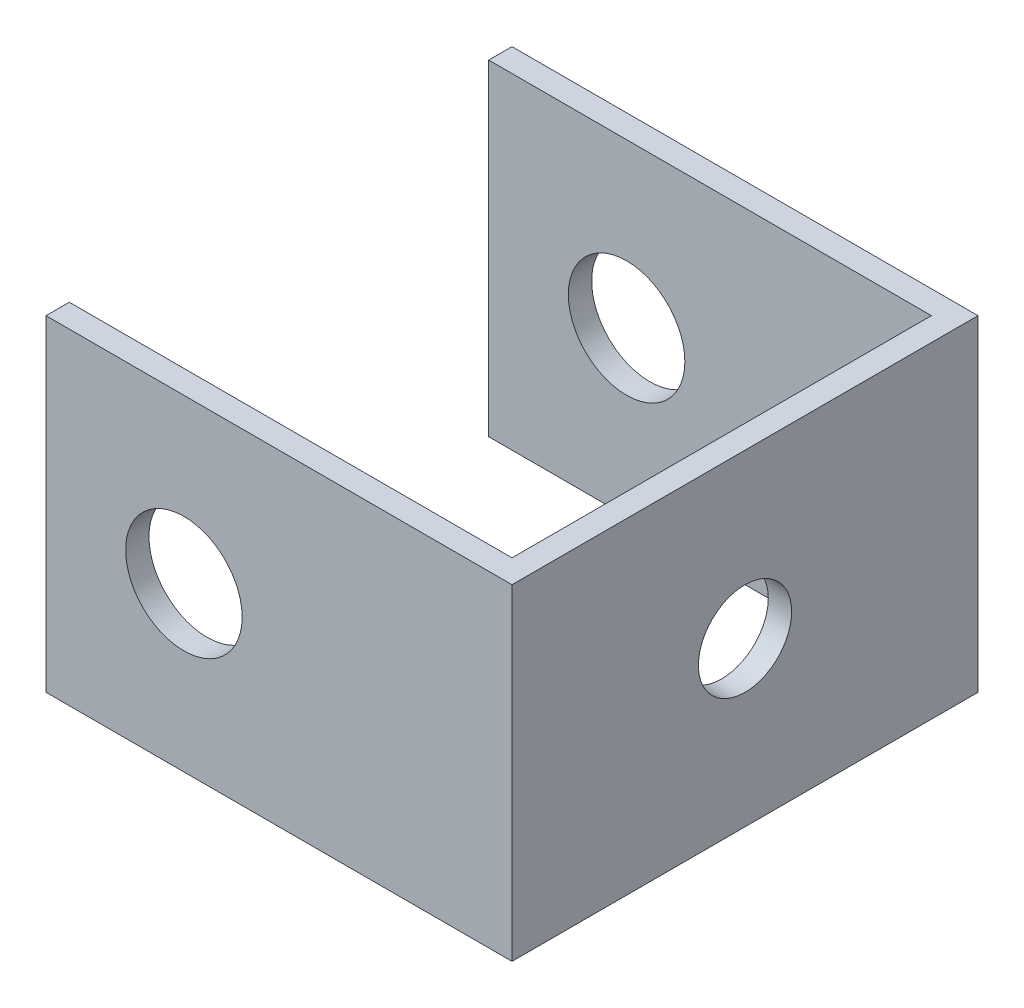
ISO-10303-21;
HEADER;
FILE_DESCRIPTION(('STEP AP214'),'2;1');
FILE_NAME('part.step','',(''),(''),'','','');
FILE_SCHEMA(('AUTOMOTIVE_DESIGN { 1 0 10303 214 1 1 1 1 }'));
ENDSEC;
DATA;
#1=APPLICATION_CONTEXT('core data for automotive mechanical design processes');
#2=APPLICATION_PROTOCOL_DEFINITION('international standard','automotive_design',2000,#1);
#3=PRODUCT_CONTEXT('',#1,'mechanical');
#4=PRODUCT('Part','Part','',(#3));
#5=PRODUCT_RELATED_PRODUCT_CATEGORY('part','',(#4));
#6=PRODUCT_DEFINITION_FORMATION('','',#4);
#7=PRODUCT_DEFINITION_CONTEXT('part definition',#1,'design');
#8=PRODUCT_DEFINITION('design','',#6,#7);
#9=PRODUCT_DEFINITION_SHAPE('','',#8);
#10=(LENGTH_UNIT() NAMED_UNIT(*) SI_UNIT(.MILLI.,.METRE.));
#11=(NAMED_UNIT(*) PLANE_ANGLE_UNIT() SI_UNIT($,.RADIAN.));
#12=(NAMED_UNIT(*) SI_UNIT($,.STERADIAN.) SOLID_ANGLE_UNIT());
#13=UNCERTAINTY_MEASURE_WITH_UNIT(LENGTH_MEASURE(1.E-05),#10,'distance_accuracy_value','');
#14=(GEOMETRIC_REPRESENTATION_CONTEXT(3) GLOBAL_UNCERTAINTY_ASSIGNED_CONTEXT((#13)) GLOBAL_UNIT_ASSIGNED_CONTEXT((#10,
#11,#12)) REPRESENTATION_CONTEXT('',''));
#15=CARTESIAN_POINT('',(0.,0.,0.));
#16=DIRECTION('',(0.,0.,1.));
#17=DIRECTION('',(1.,0.,0.));
#18=AXIS2_PLACEMENT_3D('',#15,#16,#17);
#19=CARTESIAN_POINT('',(0.,14.,-8.99999999999999));
#20=DIRECTION('',(0.,0.,-1.));
#21=DIRECTION('',(-1.,0.,0.));
#22=AXIS2_PLACEMENT_3D('',#19,#20,#21);
#23=PLANE('',#22);
#24=CARTESIAN_POINT('',(-4.08171011667946,7.,-8.99999999999999));
#25=DIRECTION('',(0.,0.,-1.));
#26=DIRECTION('',(-1.,0.,0.));
#27=AXIS2_PLACEMENT_3D('',#24,#25,#26);
#28=CIRCLE('',#27,2.5);
#29=CARTESIAN_POINT('',(-6.58171011667946,7.,-8.99999999999999));
#30=VERTEX_POINT('',#29);
#31=EDGE_CURVE('E136',#30,#30,#28,.T.);
#32=ORIENTED_EDGE('',*,*,#31,.T.);
#33=EDGE_LOOP('',(#32));
#34=FACE_BOUND('',#33,.T.);
#35=DIRECTION('',(1.,0.,0.));
#36=VECTOR('',#35,1.);
#37=CARTESIAN_POINT('',(0.,0.,-8.99999999999999));
#38=LINE('',#37,#36);
#39=CARTESIAN_POINT('',(-10.,0.,-8.99999999999999));
#40=VERTEX_POINT('',#39);
#41=CARTESIAN_POINT('',(9.,0.,-8.99999999999999));
#42=VERTEX_POINT('',#41);
#43=EDGE_CURVE('E133',#40,#42,#38,.T.);
#44=ORIENTED_EDGE('',*,*,#43,.T.);
#45=DIRECTION('',(0.,-1.,0.));
#46=VECTOR('',#45,1.);
#47=CARTESIAN_POINT('',(9.,14.,-8.99999999999999));
#48=LINE('',#47,#46);
#49=CARTESIAN_POINT('',(9.,14.,-8.99999999999999));
#50=VERTEX_POINT('',#49);
#51=EDGE_CURVE('E11',#50,#42,#48,.T.);
#52=ORIENTED_EDGE('',*,*,#51,.F.);
#53=DIRECTION('',(1.,0.,0.));
#54=VECTOR('',#53,1.);
#55=CARTESIAN_POINT('',(0.,14.,-8.99999999999999));
#56=LINE('',#55,#54);
#57=CARTESIAN_POINT('',(-10.,14.,-8.99999999999999));
#58=VERTEX_POINT('',#57);
#59=EDGE_CURVE('E174',#58,#50,#56,.T.);
#60=ORIENTED_EDGE('',*,*,#59,.F.);
#61=DIRECTION('',(0.,-1.,0.));
#62=VECTOR('',#61,1.);
#63=CARTESIAN_POINT('',(-10.,14.,-8.99999999999999));
#64=LINE('',#63,#62);
#65=EDGE_CURVE('E51',#58,#40,#64,.T.);
#66=ORIENTED_EDGE('',*,*,#65,.T.);
#67=EDGE_LOOP('',(#44,#52,#60,#66));
#68=FACE_BOUND('',#67,.T.);
#69=ADVANCED_FACE('F35',(#34,#68),#23,.F.);
#70=CARTESIAN_POINT('',(9.,14.,0.));
#71=DIRECTION('',(1.,0.,0.));
#72=DIRECTION('',(0.,0.,-1.));
#73=AXIS2_PLACEMENT_3D('',#70,#71,#72);
#74=PLANE('',#73);
#75=CARTESIAN_POINT('',(9.,7.,0.));
#76=DIRECTION('',(1.,0.,0.));
#77=DIRECTION('',(0.,0.,-1.));
#78=AXIS2_PLACEMENT_3D('',#75,#76,#77);
#79=CIRCLE('',#78,2.);
#80=CARTESIAN_POINT('',(9.,7.,-2.));
#81=VERTEX_POINT('',#80);
#82=EDGE_CURVE('E192',#81,#81,#79,.F.);
#83=ORIENTED_EDGE('',*,*,#82,.F.);
#84=EDGE_LOOP('',(#83));
#85=FACE_BOUND('',#84,.T.);
#86=DIRECTION('',(0.,0.,1.));
#87=VECTOR('',#86,1.);
#88=CARTESIAN_POINT('',(9.,0.,0.));
#89=LINE('',#88,#87);
#90=CARTESIAN_POINT('',(9.00000000000001,0.,9.00000000000001));
#91=VERTEX_POINT('',#90);
#92=EDGE_CURVE('E135',#42,#91,#89,.T.);
#93=ORIENTED_EDGE('',*,*,#92,.T.);
#94=DIRECTION('',(0.,-1.,0.));
#95=VECTOR('',#94,1.);
#96=CARTESIAN_POINT('',(9.00000000000001,14.,9.00000000000001));
#97=LINE('',#96,#95);
#98=CARTESIAN_POINT('',(9.00000000000001,14.,9.00000000000001));
#99=VERTEX_POINT('',#98);
#100=EDGE_CURVE('E43',#99,#91,#97,.T.);
#101=ORIENTED_EDGE('',*,*,#100,.F.);
#102=DIRECTION('',(0.,0.,1.));
#103=VECTOR('',#102,1.);
#104=CARTESIAN_POINT('',(9.,14.,0.));
#105=LINE('',#104,#103);
#106=EDGE_CURVE('E90',#50,#99,#105,.T.);
#107=ORIENTED_EDGE('',*,*,#106,.F.);
#108=ORIENTED_EDGE('',*,*,#51,.T.);
#109=EDGE_LOOP('',(#93,#101,#107,#108));
#110=FACE_BOUND('',#109,.T.);
#111=ADVANCED_FACE('F164',(#85,#110),#74,.F.);
#112=CARTESIAN_POINT('',(0.,14.,9.00000000000001));
#113=DIRECTION('',(0.,0.,-1.));
#114=DIRECTION('',(-1.,0.,0.));
#115=AXIS2_PLACEMENT_3D('',#112,#113,#114);
#116=PLANE('',#115);
#117=CARTESIAN_POINT('',(-4.08171011667946,7.,9.00000000000001));
#118=DIRECTION('',(0.,0.,-1.));
#119=DIRECTION('',(-1.,0.,0.));
#120=AXIS2_PLACEMENT_3D('',#117,#118,#119);
#121=CIRCLE('',#120,2.5);
#122=CARTESIAN_POINT('',(-6.58171011667946,7.,9.00000000000001));
#123=VERTEX_POINT('',#122);
#124=EDGE_CURVE('E183',#123,#123,#121,.T.);
#125=ORIENTED_EDGE('',*,*,#124,.F.);
#126=EDGE_LOOP('',(#125));
#127=FACE_BOUND('',#126,.T.);
#128=DIRECTION('',(1.,0.,0.));
#129=VECTOR('',#128,1.);
#130=CARTESIAN_POINT('',(0.,0.,9.00000000000001));
#131=LINE('',#130,#129);
#132=CARTESIAN_POINT('',(-10.,0.,9.00000000000001));
#133=VERTEX_POINT('',#132);
#134=EDGE_CURVE('E139',#133,#91,#131,.T.);
#135=ORIENTED_EDGE('',*,*,#134,.F.);
#136=DIRECTION('',(0.,-1.,0.));
#137=VECTOR('',#136,1.);
#138=CARTESIAN_POINT('',(-10.,14.,9.00000000000001));
#139=LINE('',#138,#137);
#140=CARTESIAN_POINT('',(-10.,14.,9.00000000000001));
#141=VERTEX_POINT('',#140);
#142=EDGE_CURVE('E157',#141,#133,#139,.T.);
#143=ORIENTED_EDGE('',*,*,#142,.F.);
#144=DIRECTION('',(1.,0.,0.));
#145=VECTOR('',#144,1.);
#146=CARTESIAN_POINT('',(0.,14.,9.00000000000001));
#147=LINE('',#146,#145);
#148=EDGE_CURVE('E163',#141,#99,#147,.T.);
#149=ORIENTED_EDGE('',*,*,#148,.T.);
#150=ORIENTED_EDGE('',*,*,#100,.T.);
#151=EDGE_LOOP('',(#135,#143,#149,#150));
#152=FACE_BOUND('',#151,.T.);
#153=ADVANCED_FACE('F161',(#127,#152),#116,.T.);
#154=CARTESIAN_POINT('',(-10.,14.,0.));
#155=DIRECTION('',(-1.,0.,0.));
#156=DIRECTION('',(0.,0.,1.));
#157=AXIS2_PLACEMENT_3D('',#154,#155,#156);
#158=PLANE('',#157);
#159=DIRECTION('',(0.,0.,-1.));
#160=VECTOR('',#159,1.);
#161=CARTESIAN_POINT('',(-10.,0.,0.));
#162=LINE('',#161,#160);
#163=CARTESIAN_POINT('',(-10.,0.,10.));
#164=VERTEX_POINT('',#163);
#165=EDGE_CURVE('E142',#164,#133,#162,.T.);
#166=ORIENTED_EDGE('',*,*,#165,.F.);
#167=DIRECTION('',(0.,-1.,0.));
#168=VECTOR('',#167,1.);
#169=CARTESIAN_POINT('',(-10.,14.,10.));
#170=LINE('',#169,#168);
#171=CARTESIAN_POINT('',(-10.,14.,10.));
#172=VERTEX_POINT('',#171);
#173=EDGE_CURVE('E155',#172,#164,#170,.T.);
#174=ORIENTED_EDGE('',*,*,#173,.F.);
#175=DIRECTION('',(0.,0.,-1.));
#176=VECTOR('',#175,1.);
#177=CARTESIAN_POINT('',(-10.,14.,0.));
#178=LINE('',#177,#176);
#179=EDGE_CURVE('E130',#172,#141,#178,.T.);
#180=ORIENTED_EDGE('',*,*,#179,.T.);
#181=ORIENTED_EDGE('',*,*,#142,.T.);
#182=EDGE_LOOP('',(#166,#174,#180,#181));
#183=FACE_BOUND('',#182,.T.);
#184=ADVANCED_FACE('F171',(#183),#158,.T.);
#185=CARTESIAN_POINT('',(0.,14.,10.));
#186=DIRECTION('',(0.,0.,1.));
#187=DIRECTION('',(1.,0.,0.));
#188=AXIS2_PLACEMENT_3D('',#185,#186,#187);
#189=PLANE('',#188);
#190=CARTESIAN_POINT('',(-4.08171011667946,7.,10.));
#191=DIRECTION('',(0.,0.,1.));
#192=DIRECTION('',(1.,0.,0.));
#193=AXIS2_PLACEMENT_3D('',#190,#191,#192);
#194=CIRCLE('',#193,2.5);
#195=CARTESIAN_POINT('',(-1.58171011667946,7.,10.));
#196=VERTEX_POINT('',#195);
#197=EDGE_CURVE('E189',#196,#196,#194,.T.);
#198=ORIENTED_EDGE('',*,*,#197,.F.);
#199=EDGE_LOOP('',(#198));
#200=FACE_BOUND('',#199,.T.);
#201=DIRECTION('',(-1.,0.,0.));
#202=VECTOR('',#201,1.);
#203=CARTESIAN_POINT('',(0.,0.,10.));
#204=LINE('',#203,#202);
#205=CARTESIAN_POINT('',(10.,0.,10.));
#206=VERTEX_POINT('',#205);
#207=EDGE_CURVE('E145',#206,#164,#204,.T.);
#208=ORIENTED_EDGE('',*,*,#207,.F.);
#209=DIRECTION('',(0.,-1.,0.));
#210=VECTOR('',#209,1.);
#211=CARTESIAN_POINT('',(10.,14.,10.));
#212=LINE('',#211,#210);
#213=CARTESIAN_POINT('',(10.,14.,10.));
#214=VERTEX_POINT('',#213);
#215=EDGE_CURVE('E124',#214,#206,#212,.T.);
#216=ORIENTED_EDGE('',*,*,#215,.F.);
#217=DIRECTION('',(-1.,0.,0.));
#218=VECTOR('',#217,1.);
#219=CARTESIAN_POINT('',(0.,14.,10.));
#220=LINE('',#219,#218);
#221=EDGE_CURVE('E114',#214,#172,#220,.T.);
#222=ORIENTED_EDGE('',*,*,#221,.T.);
#223=ORIENTED_EDGE('',*,*,#173,.T.);
#224=EDGE_LOOP('',(#208,#216,#222,#223));
#225=FACE_BOUND('',#224,.T.);
#226=ADVANCED_FACE('F178',(#200,#225),#189,.T.);
#227=CARTESIAN_POINT('',(10.,14.,0.));
#228=DIRECTION('',(-1.,0.,0.));
#229=DIRECTION('',(0.,0.,1.));
#230=AXIS2_PLACEMENT_3D('',#227,#228,#229);
#231=PLANE('',#230);
#232=CARTESIAN_POINT('',(10.,7.,0.));
#233=DIRECTION('',(1.,0.,0.));
#234=DIRECTION('',(0.,0.,-1.));
#235=AXIS2_PLACEMENT_3D('',#232,#233,#234);
#236=CIRCLE('',#235,2.);
#237=CARTESIAN_POINT('',(10.,7.,-2.));
#238=VERTEX_POINT('',#237);
#239=EDGE_CURVE('E195',#238,#238,#236,.T.);
#240=ORIENTED_EDGE('',*,*,#239,.F.);
#241=EDGE_LOOP('',(#240));
#242=FACE_BOUND('',#241,.T.);
#243=DIRECTION('',(0.,0.,-1.));
#244=VECTOR('',#243,1.);
#245=CARTESIAN_POINT('',(10.,0.,0.));
#246=LINE('',#245,#244);
#247=CARTESIAN_POINT('',(10.,0.,-10.));
#248=VERTEX_POINT('',#247);
#249=EDGE_CURVE('E121',#206,#248,#246,.T.);
#250=ORIENTED_EDGE('',*,*,#249,.T.);
#251=DIRECTION('',(0.,-1.,0.));
#252=VECTOR('',#251,1.);
#253=CARTESIAN_POINT('',(10.,14.,-10.));
#254=LINE('',#253,#252);
#255=CARTESIAN_POINT('',(10.,14.,-10.));
#256=VERTEX_POINT('',#255);
#257=EDGE_CURVE('E118',#256,#248,#254,.T.);
#258=ORIENTED_EDGE('',*,*,#257,.F.);
#259=DIRECTION('',(0.,0.,-1.));
#260=VECTOR('',#259,1.);
#261=CARTESIAN_POINT('',(10.,14.,0.));
#262=LINE('',#261,#260);
#263=EDGE_CURVE('E106',#214,#256,#262,.T.);
#264=ORIENTED_EDGE('',*,*,#263,.F.);
#265=ORIENTED_EDGE('',*,*,#215,.T.);
#266=EDGE_LOOP('',(#250,#258,#264,#265));
#267=FACE_BOUND('',#266,.T.);
#268=ADVANCED_FACE('F119',(#242,#267),#231,.F.);
#269=CARTESIAN_POINT('',(0.,14.,-10.));
#270=DIRECTION('',(0.,0.,1.));
#271=DIRECTION('',(1.,0.,0.));
#272=AXIS2_PLACEMENT_3D('',#269,#270,#271);
#273=PLANE('',#272);
#274=CARTESIAN_POINT('',(-4.08171011667946,7.,-10.));
#275=DIRECTION('',(0.,0.,1.));
#276=DIRECTION('',(1.,0.,0.));
#277=AXIS2_PLACEMENT_3D('',#274,#275,#276);
#278=CIRCLE('',#277,2.5);
#279=CARTESIAN_POINT('',(-1.58171011667946,7.,-10.));
#280=VERTEX_POINT('',#279);
#281=EDGE_CURVE('E186',#280,#280,#278,.F.);
#282=ORIENTED_EDGE('',*,*,#281,.F.);
#283=EDGE_LOOP('',(#282));
#284=FACE_BOUND('',#283,.T.);
#285=DIRECTION('',(-1.,0.,0.));
#286=VECTOR('',#285,1.);
#287=CARTESIAN_POINT('',(0.,0.,-10.));
#288=LINE('',#287,#286);
#289=CARTESIAN_POINT('',(-10.,0.,-10.));
#290=VERTEX_POINT('',#289);
#291=EDGE_CURVE('E150',#248,#290,#288,.T.);
#292=ORIENTED_EDGE('',*,*,#291,.T.);
#293=DIRECTION('',(0.,-1.,0.));
#294=VECTOR('',#293,1.);
#295=CARTESIAN_POINT('',(-10.,14.,-10.));
#296=LINE('',#295,#294);
#297=CARTESIAN_POINT('',(-10.,14.,-10.));
#298=VERTEX_POINT('',#297);
#299=EDGE_CURVE('E78',#298,#290,#296,.T.);
#300=ORIENTED_EDGE('',*,*,#299,.F.);
#301=DIRECTION('',(-1.,0.,0.));
#302=VECTOR('',#301,1.);
#303=CARTESIAN_POINT('',(0.,14.,-10.));
#304=LINE('',#303,#302);
#305=EDGE_CURVE('E111',#256,#298,#304,.T.);
#306=ORIENTED_EDGE('',*,*,#305,.F.);
#307=ORIENTED_EDGE('',*,*,#257,.T.);
#308=EDGE_LOOP('',(#292,#300,#306,#307));
#309=FACE_BOUND('',#308,.T.);
#310=ADVANCED_FACE('F126',(#284,#309),#273,.F.);
#311=EDGE_CURVE('E146',#40,#290,#162,.T.);
#312=ORIENTED_EDGE('',*,*,#311,.F.);
#313=ORIENTED_EDGE('',*,*,#65,.F.);
#314=EDGE_CURVE('E127',#58,#298,#178,.T.);
#315=ORIENTED_EDGE('',*,*,#314,.T.);
#316=ORIENTED_EDGE('',*,*,#299,.T.);
#317=EDGE_LOOP('',(#312,#313,#315,#316));
#318=FACE_BOUND('',#317,.T.);
#319=ADVANCED_FACE('F208',(#318),#158,.T.);
#320=CARTESIAN_POINT('',(0.,14.,0.));
#321=DIRECTION('',(0.,1.,0.));
#322=DIRECTION('',(0.,0.,1.));
#323=AXIS2_PLACEMENT_3D('',#320,#321,#322);
#324=PLANE('',#323);
#325=ORIENTED_EDGE('',*,*,#59,.T.);
#326=ORIENTED_EDGE('',*,*,#106,.T.);
#327=ORIENTED_EDGE('',*,*,#148,.F.);
#328=ORIENTED_EDGE('',*,*,#179,.F.);
#329=ORIENTED_EDGE('',*,*,#221,.F.);
#330=ORIENTED_EDGE('',*,*,#263,.T.);
#331=ORIENTED_EDGE('',*,*,#305,.T.);
#332=ORIENTED_EDGE('',*,*,#314,.F.);
#333=EDGE_LOOP('',(#325,#326,#327,#328,#329,#330,#331,#332));
#334=FACE_BOUND('',#333,.T.);
#335=ADVANCED_FACE('F108',(#334),#324,.T.);
#336=CARTESIAN_POINT('',(0.,0.,0.));
#337=DIRECTION('',(0.,1.,0.));
#338=DIRECTION('',(0.,0.,1.));
#339=AXIS2_PLACEMENT_3D('',#336,#337,#338);
#340=PLANE('',#339);
#341=ORIENTED_EDGE('',*,*,#43,.F.);
#342=ORIENTED_EDGE('',*,*,#311,.T.);
#343=ORIENTED_EDGE('',*,*,#291,.F.);
#344=ORIENTED_EDGE('',*,*,#249,.F.);
#345=ORIENTED_EDGE('',*,*,#207,.T.);
#346=ORIENTED_EDGE('',*,*,#165,.T.);
#347=ORIENTED_EDGE('',*,*,#134,.T.);
#348=ORIENTED_EDGE('',*,*,#92,.F.);
#349=EDGE_LOOP('',(#341,#342,#343,#344,#345,#346,#347,#348));
#350=FACE_BOUND('',#349,.T.);
#351=ADVANCED_FACE('F167',(#350),#340,.F.);
#352=CARTESIAN_POINT('',(-4.08171011667946,7.,-17.0710678118655));
#353=DIRECTION('',(0.,0.,1.));
#354=DIRECTION('',(1.,0.,0.));
#355=AXIS2_PLACEMENT_3D('',#352,#353,#354);
#356=CYLINDRICAL_SURFACE('',#355,2.5);
#357=ORIENTED_EDGE('',*,*,#281,.T.);
#358=EDGE_LOOP('',(#357));
#359=FACE_BOUND('',#358,.T.);
#360=ORIENTED_EDGE('',*,*,#31,.F.);
#361=EDGE_LOOP('',(#360));
#362=FACE_BOUND('',#361,.T.);
#363=ADVANCED_FACE('F240',(#359,#362),#356,.F.);
#364=ORIENTED_EDGE('',*,*,#124,.T.);
#365=EDGE_LOOP('',(#364));
#366=FACE_BOUND('',#365,.T.);
#367=ORIENTED_EDGE('',*,*,#197,.T.);
#368=EDGE_LOOP('',(#367));
#369=FACE_BOUND('',#368,.T.);
#370=ADVANCED_FACE('F237',(#366,#369),#356,.F.);
#371=CARTESIAN_POINT('',(-10.001,7.,0.));
#372=DIRECTION('',(1.,0.,0.));
#373=DIRECTION('',(0.,0.,-1.));
#374=AXIS2_PLACEMENT_3D('',#371,#372,#373);
#375=CYLINDRICAL_SURFACE('',#374,2.);
#376=ORIENTED_EDGE('',*,*,#239,.T.);
#377=EDGE_LOOP('',(#376));
#378=FACE_BOUND('',#377,.T.);
#379=ORIENTED_EDGE('',*,*,#82,.T.);
#380=EDGE_LOOP('',(#379));
#381=FACE_BOUND('',#380,.T.);
#382=ADVANCED_FACE('F199',(#378,#381),#375,.F.);
#383=CLOSED_SHELL('',(#69,#111,#153,#184,#226,#268,#310,#319,#335,#351,#363,#370,#382));
#384=MANIFOLD_SOLID_BREP('B2',#383);
#385=ADVANCED_BREP_SHAPE_REPRESENTATION('',(#18,#384),#14);
#386=SHAPE_DEFINITION_REPRESENTATION(#9,#385);
ENDSEC;
END-ISO-10303-21;
